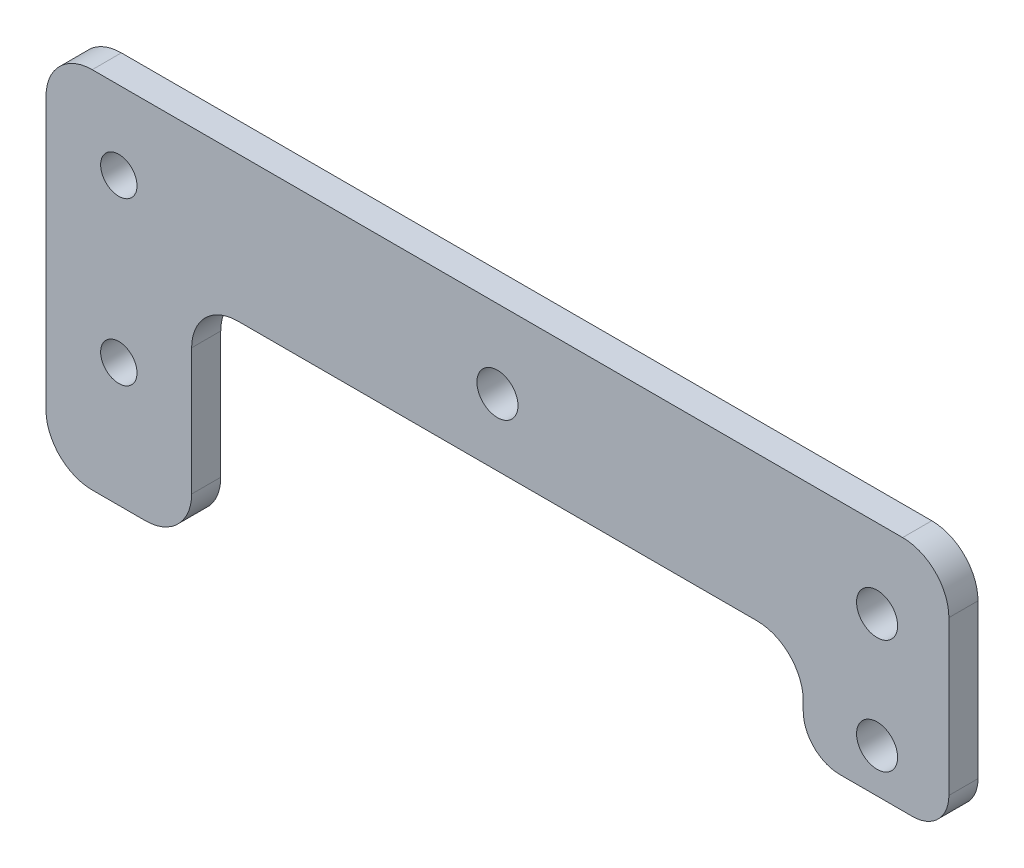
ISO-10303-21;
HEADER;
FILE_DESCRIPTION(('STEP AP214'),'2;1');
FILE_NAME('part.step','',(''),(''),'','','');
FILE_SCHEMA(('AUTOMOTIVE_DESIGN { 1 0 10303 214 1 1 1 1 }'));
ENDSEC;
DATA;
#1=APPLICATION_CONTEXT('core data for automotive mechanical design processes');
#2=APPLICATION_PROTOCOL_DEFINITION('international standard','automotive_design',2000,#1);
#3=PRODUCT_CONTEXT('',#1,'mechanical');
#4=PRODUCT('Part','Part','',(#3));
#5=PRODUCT_RELATED_PRODUCT_CATEGORY('part','',(#4));
#6=PRODUCT_DEFINITION_FORMATION('','',#4);
#7=PRODUCT_DEFINITION_CONTEXT('part definition',#1,'design');
#8=PRODUCT_DEFINITION('design','',#6,#7);
#9=PRODUCT_DEFINITION_SHAPE('','',#8);
#10=(LENGTH_UNIT() NAMED_UNIT(*) SI_UNIT(.MILLI.,.METRE.));
#11=(NAMED_UNIT(*) PLANE_ANGLE_UNIT() SI_UNIT($,.RADIAN.));
#12=(NAMED_UNIT(*) SI_UNIT($,.STERADIAN.) SOLID_ANGLE_UNIT());
#13=UNCERTAINTY_MEASURE_WITH_UNIT(LENGTH_MEASURE(1.E-05),#10,'distance_accuracy_value','');
#14=(GEOMETRIC_REPRESENTATION_CONTEXT(3) GLOBAL_UNCERTAINTY_ASSIGNED_CONTEXT((#13)) GLOBAL_UNIT_ASSIGNED_CONTEXT((#10,
#11,#12)) REPRESENTATION_CONTEXT('',''));
#15=CARTESIAN_POINT('',(0.,0.,0.));
#16=DIRECTION('',(0.,0.,1.));
#17=DIRECTION('',(1.,0.,0.));
#18=AXIS2_PLACEMENT_3D('',#15,#16,#17);
#19=CARTESIAN_POINT('',(0.,26.6043563241678,4.));
#20=DIRECTION('',(0.,1.,0.));
#21=DIRECTION('',(-1.,0.,0.));
#22=AXIS2_PLACEMENT_3D('',#19,#20,#21);
#23=PLANE('',#22);
#24=DIRECTION('',(1.,0.,0.));
#25=VECTOR('',#24,1.);
#26=CARTESIAN_POINT('',(0.,26.6043563241678,0.));
#27=LINE('',#26,#25);
#28=CARTESIAN_POINT('',(6.39337520482172,26.6043563241678,0.));
#29=VERTEX_POINT('',#28);
#30=CARTESIAN_POINT('',(117.693375204822,26.6043563241678,0.));
#31=VERTEX_POINT('',#30);
#32=EDGE_CURVE('E216',#29,#31,#27,.T.);
#33=ORIENTED_EDGE('',*,*,#32,.F.);
#34=DIRECTION('',(0.,0.,-1.));
#35=VECTOR('',#34,1.);
#36=CARTESIAN_POINT('',(6.39337520482172,26.6043563241678,4.));
#37=LINE('',#36,#35);
#38=CARTESIAN_POINT('',(6.39337520482172,26.6043563241678,4.));
#39=VERTEX_POINT('',#38);
#40=EDGE_CURVE('E11',#39,#29,#37,.T.);
#41=ORIENTED_EDGE('',*,*,#40,.F.);
#42=DIRECTION('',(1.,0.,0.));
#43=VECTOR('',#42,1.);
#44=CARTESIAN_POINT('',(0.,26.6043563241678,4.));
#45=LINE('',#44,#43);
#46=CARTESIAN_POINT('',(117.693375204822,26.6043563241678,4.));
#47=VERTEX_POINT('',#46);
#48=EDGE_CURVE('E351',#39,#47,#45,.T.);
#49=ORIENTED_EDGE('',*,*,#48,.T.);
#50=DIRECTION('',(0.,0.,-1.));
#51=VECTOR('',#50,1.);
#52=CARTESIAN_POINT('',(117.693375204822,26.6043563241678,4.));
#53=LINE('',#52,#51);
#54=EDGE_CURVE('E123',#47,#31,#53,.T.);
#55=ORIENTED_EDGE('',*,*,#54,.T.);
#56=EDGE_LOOP('',(#33,#41,#49,#55));
#57=FACE_BOUND('',#56,.T.);
#58=ADVANCED_FACE('F47',(#57),#23,.T.);
#59=CARTESIAN_POINT('',(6.39337520482172,20.2543563241678,4.));
#60=DIRECTION('',(0.,0.,-1.));
#61=DIRECTION('',(-1.,0.,0.));
#62=AXIS2_PLACEMENT_3D('',#59,#60,#61);
#63=CYLINDRICAL_SURFACE('',#62,6.35);
#64=CARTESIAN_POINT('',(6.39337520482172,20.2543563241678,0.));
#65=DIRECTION('',(0.,0.,1.));
#66=DIRECTION('',(1.,0.,0.));
#67=AXIS2_PLACEMENT_3D('',#64,#65,#66);
#68=CIRCLE('',#67,6.35);
#69=CARTESIAN_POINT('',(0.0433752048217246,20.2543563241678,0.));
#70=VERTEX_POINT('',#69);
#71=EDGE_CURVE('E220',#29,#70,#68,.T.);
#72=ORIENTED_EDGE('',*,*,#71,.T.);
#73=DIRECTION('',(0.,0.,-1.));
#74=VECTOR('',#73,1.);
#75=CARTESIAN_POINT('',(0.0433752048217246,20.2543563241678,4.));
#76=LINE('',#75,#74);
#77=CARTESIAN_POINT('',(0.0433752048217246,20.2543563241678,4.));
#78=VERTEX_POINT('',#77);
#79=EDGE_CURVE('E57',#78,#70,#76,.T.);
#80=ORIENTED_EDGE('',*,*,#79,.F.);
#81=CARTESIAN_POINT('',(6.39337520482172,20.2543563241678,4.));
#82=DIRECTION('',(0.,0.,1.));
#83=DIRECTION('',(1.,0.,0.));
#84=AXIS2_PLACEMENT_3D('',#81,#82,#83);
#85=CIRCLE('',#84,6.35);
#86=EDGE_CURVE('E344',#39,#78,#85,.T.);
#87=ORIENTED_EDGE('',*,*,#86,.F.);
#88=ORIENTED_EDGE('',*,*,#40,.T.);
#89=EDGE_LOOP('',(#72,#80,#87,#88));
#90=FACE_BOUND('',#89,.T.);
#91=ADVANCED_FACE('F331',(#90),#63,.T.);
#92=CARTESIAN_POINT('',(0.0433752048217246,0.,4.));
#93=DIRECTION('',(-1.,0.,0.));
#94=DIRECTION('',(0.,-1.,0.));
#95=AXIS2_PLACEMENT_3D('',#92,#93,#94);
#96=PLANE('',#95);
#97=DIRECTION('',(0.,1.,0.));
#98=VECTOR('',#97,1.);
#99=CARTESIAN_POINT('',(0.0433752048217246,0.,0.));
#100=LINE('',#99,#98);
#101=CARTESIAN_POINT('',(0.0433752048217247,-17.0456436758322,0.));
#102=VERTEX_POINT('',#101);
#103=EDGE_CURVE('E224',#102,#70,#100,.T.);
#104=ORIENTED_EDGE('',*,*,#103,.F.);
#105=DIRECTION('',(0.,0.,-1.));
#106=VECTOR('',#105,1.);
#107=CARTESIAN_POINT('',(0.0433752048217247,-17.0456436758322,4.));
#108=LINE('',#107,#106);
#109=CARTESIAN_POINT('',(0.0433752048217247,-17.0456436758322,4.));
#110=VERTEX_POINT('',#109);
#111=EDGE_CURVE('E319',#110,#102,#108,.T.);
#112=ORIENTED_EDGE('',*,*,#111,.F.);
#113=DIRECTION('',(0.,1.,0.));
#114=VECTOR('',#113,1.);
#115=CARTESIAN_POINT('',(0.0433752048217246,0.,4.));
#116=LINE('',#115,#114);
#117=EDGE_CURVE('E328',#110,#78,#116,.T.);
#118=ORIENTED_EDGE('',*,*,#117,.T.);
#119=ORIENTED_EDGE('',*,*,#79,.T.);
#120=EDGE_LOOP('',(#104,#112,#118,#119));
#121=FACE_BOUND('',#120,.T.);
#122=ADVANCED_FACE('F326',(#121),#96,.T.);
#123=CARTESIAN_POINT('',(6.39337520482172,-17.0456436758322,4.));
#124=DIRECTION('',(0.,0.,-1.));
#125=DIRECTION('',(-1.,0.,0.));
#126=AXIS2_PLACEMENT_3D('',#123,#124,#125);
#127=CYLINDRICAL_SURFACE('',#126,6.35);
#128=CARTESIAN_POINT('',(6.39337520482172,-17.0456436758322,0.));
#129=DIRECTION('',(0.,0.,1.));
#130=DIRECTION('',(1.,0.,0.));
#131=AXIS2_PLACEMENT_3D('',#128,#129,#130);
#132=CIRCLE('',#131,6.35);
#133=CARTESIAN_POINT('',(6.39337520482172,-23.3956436758322,0.));
#134=VERTEX_POINT('',#133);
#135=EDGE_CURVE('E228',#134,#102,#132,.F.);
#136=ORIENTED_EDGE('',*,*,#135,.F.);
#137=DIRECTION('',(0.,0.,-1.));
#138=VECTOR('',#137,1.);
#139=CARTESIAN_POINT('',(6.39337520482172,-23.3956436758322,4.));
#140=LINE('',#139,#138);
#141=CARTESIAN_POINT('',(6.39337520482172,-23.3956436758322,4.));
#142=VERTEX_POINT('',#141);
#143=EDGE_CURVE('E316',#142,#134,#140,.T.);
#144=ORIENTED_EDGE('',*,*,#143,.F.);
#145=CARTESIAN_POINT('',(6.39337520482172,-17.0456436758322,4.));
#146=DIRECTION('',(0.,0.,1.));
#147=DIRECTION('',(1.,0.,0.));
#148=AXIS2_PLACEMENT_3D('',#145,#146,#147);
#149=CIRCLE('',#148,6.35);
#150=EDGE_CURVE('E342',#142,#110,#149,.F.);
#151=ORIENTED_EDGE('',*,*,#150,.T.);
#152=ORIENTED_EDGE('',*,*,#111,.T.);
#153=EDGE_LOOP('',(#136,#144,#151,#152));
#154=FACE_BOUND('',#153,.T.);
#155=ADVANCED_FACE('F338',(#154),#127,.T.);
#156=CARTESIAN_POINT('',(0.,-23.3956436758322,4.));
#157=DIRECTION('',(0.,1.,0.));
#158=DIRECTION('',(0.,0.,1.));
#159=AXIS2_PLACEMENT_3D('',#156,#157,#158);
#160=PLANE('',#159);
#161=DIRECTION('',(1.,0.,0.));
#162=VECTOR('',#161,1.);
#163=CARTESIAN_POINT('',(0.,-23.3956436758322,0.));
#164=LINE('',#163,#162);
#165=CARTESIAN_POINT('',(13.6933752048217,-23.3956436758322,0.));
#166=VERTEX_POINT('',#165);
#167=EDGE_CURVE('E232',#134,#166,#164,.T.);
#168=ORIENTED_EDGE('',*,*,#167,.T.);
#169=DIRECTION('',(0.,0.,-1.));
#170=VECTOR('',#169,1.);
#171=CARTESIAN_POINT('',(13.6933752048217,-23.3956436758322,4.));
#172=LINE('',#171,#170);
#173=CARTESIAN_POINT('',(13.6933752048217,-23.3956436758322,4.));
#174=VERTEX_POINT('',#173);
#175=EDGE_CURVE('E312',#174,#166,#172,.T.);
#176=ORIENTED_EDGE('',*,*,#175,.F.);
#177=DIRECTION('',(1.,0.,0.));
#178=VECTOR('',#177,1.);
#179=CARTESIAN_POINT('',(0.,-23.3956436758322,4.));
#180=LINE('',#179,#178);
#181=EDGE_CURVE('E349',#142,#174,#180,.T.);
#182=ORIENTED_EDGE('',*,*,#181,.F.);
#183=ORIENTED_EDGE('',*,*,#143,.T.);
#184=EDGE_LOOP('',(#168,#176,#182,#183));
#185=FACE_BOUND('',#184,.T.);
#186=ADVANCED_FACE('F487',(#185),#160,.F.);
#187=CARTESIAN_POINT('',(13.6933752048217,-17.0456436758322,4.));
#188=DIRECTION('',(0.,0.,-1.));
#189=DIRECTION('',(-1.,0.,0.));
#190=AXIS2_PLACEMENT_3D('',#187,#188,#189);
#191=CYLINDRICAL_SURFACE('',#190,6.35);
#192=CARTESIAN_POINT('',(13.6933752048217,-17.0456436758322,0.));
#193=DIRECTION('',(0.,0.,1.));
#194=DIRECTION('',(1.,0.,0.));
#195=AXIS2_PLACEMENT_3D('',#192,#193,#194);
#196=CIRCLE('',#195,6.35);
#197=CARTESIAN_POINT('',(20.0433752048217,-17.0456436758322,0.));
#198=VERTEX_POINT('',#197);
#199=EDGE_CURVE('E236',#166,#198,#196,.T.);
#200=ORIENTED_EDGE('',*,*,#199,.T.);
#201=DIRECTION('',(0.,0.,-1.));
#202=VECTOR('',#201,1.);
#203=CARTESIAN_POINT('',(20.0433752048217,-17.0456436758322,4.));
#204=LINE('',#203,#202);
#205=CARTESIAN_POINT('',(20.0433752048217,-17.0456436758322,4.));
#206=VERTEX_POINT('',#205);
#207=EDGE_CURVE('E309',#206,#198,#204,.T.);
#208=ORIENTED_EDGE('',*,*,#207,.F.);
#209=CARTESIAN_POINT('',(13.6933752048217,-17.0456436758322,4.));
#210=DIRECTION('',(0.,0.,1.));
#211=DIRECTION('',(1.,0.,0.));
#212=AXIS2_PLACEMENT_3D('',#209,#210,#211);
#213=CIRCLE('',#212,6.35);
#214=EDGE_CURVE('E357',#174,#206,#213,.T.);
#215=ORIENTED_EDGE('',*,*,#214,.F.);
#216=ORIENTED_EDGE('',*,*,#175,.T.);
#217=EDGE_LOOP('',(#200,#208,#215,#216));
#218=FACE_BOUND('',#217,.T.);
#219=ADVANCED_FACE('F483',(#218),#191,.T.);
#220=CARTESIAN_POINT('',(20.0433752048217,0.,4.));
#221=DIRECTION('',(1.,0.,0.));
#222=DIRECTION('',(0.,1.,0.));
#223=AXIS2_PLACEMENT_3D('',#220,#221,#222);
#224=PLANE('',#223);
#225=DIRECTION('',(0.,-1.,0.));
#226=VECTOR('',#225,1.);
#227=CARTESIAN_POINT('',(20.0433752048217,0.,0.));
#228=LINE('',#227,#226);
#229=CARTESIAN_POINT('',(20.0433752048217,0.349416953919621,0.));
#230=VERTEX_POINT('',#229);
#231=EDGE_CURVE('E240',#230,#198,#228,.T.);
#232=ORIENTED_EDGE('',*,*,#231,.F.);
#233=DIRECTION('',(0.,0.,-1.));
#234=VECTOR('',#233,1.);
#235=CARTESIAN_POINT('',(20.0433752048217,0.349416953919621,4.));
#236=LINE('',#235,#234);
#237=CARTESIAN_POINT('',(20.0433752048217,0.349416953919621,4.));
#238=VERTEX_POINT('',#237);
#239=EDGE_CURVE('E306',#238,#230,#236,.T.);
#240=ORIENTED_EDGE('',*,*,#239,.F.);
#241=DIRECTION('',(0.,-1.,0.));
#242=VECTOR('',#241,1.);
#243=CARTESIAN_POINT('',(20.0433752048217,0.,4.));
#244=LINE('',#243,#242);
#245=EDGE_CURVE('E360',#238,#206,#244,.T.);
#246=ORIENTED_EDGE('',*,*,#245,.T.);
#247=ORIENTED_EDGE('',*,*,#207,.T.);
#248=EDGE_LOOP('',(#232,#240,#246,#247));
#249=FACE_BOUND('',#248,.T.);
#250=ADVANCED_FACE('F479',(#249),#224,.T.);
#251=CARTESIAN_POINT('',(26.3933752048217,0.349416953919621,4.));
#252=DIRECTION('',(0.,0.,-1.));
#253=DIRECTION('',(-1.,0.,0.));
#254=AXIS2_PLACEMENT_3D('',#251,#252,#253);
#255=CYLINDRICAL_SURFACE('',#254,6.35);
#256=CARTESIAN_POINT('',(26.3933752048217,0.349416953919621,0.));
#257=DIRECTION('',(0.,0.,1.));
#258=DIRECTION('',(1.,0.,0.));
#259=AXIS2_PLACEMENT_3D('',#256,#257,#258);
#260=CIRCLE('',#259,6.35);
#261=CARTESIAN_POINT('',(26.3933752048217,6.69941695391962,0.));
#262=VERTEX_POINT('',#261);
#263=EDGE_CURVE('E244',#262,#230,#260,.T.);
#264=ORIENTED_EDGE('',*,*,#263,.F.);
#265=DIRECTION('',(0.,0.,-1.));
#266=VECTOR('',#265,1.);
#267=CARTESIAN_POINT('',(26.3933752048217,6.69941695391962,4.));
#268=LINE('',#267,#266);
#269=CARTESIAN_POINT('',(26.3933752048217,6.69941695391962,4.));
#270=VERTEX_POINT('',#269);
#271=EDGE_CURVE('E303',#270,#262,#268,.T.);
#272=ORIENTED_EDGE('',*,*,#271,.F.);
#273=CARTESIAN_POINT('',(26.3933752048217,0.349416953919621,4.));
#274=DIRECTION('',(0.,0.,1.));
#275=DIRECTION('',(1.,0.,0.));
#276=AXIS2_PLACEMENT_3D('',#273,#274,#275);
#277=CIRCLE('',#276,6.35);
#278=EDGE_CURVE('E364',#270,#238,#277,.T.);
#279=ORIENTED_EDGE('',*,*,#278,.T.);
#280=ORIENTED_EDGE('',*,*,#239,.T.);
#281=EDGE_LOOP('',(#264,#272,#279,#280));
#282=FACE_BOUND('',#281,.T.);
#283=ADVANCED_FACE('F475',(#282),#255,.F.);
#284=CARTESIAN_POINT('',(0.,6.69941695391962,4.));
#285=DIRECTION('',(0.,1.,0.));
#286=DIRECTION('',(0.,0.,1.));
#287=AXIS2_PLACEMENT_3D('',#284,#285,#286);
#288=PLANE('',#287);
#289=DIRECTION('',(1.,0.,0.));
#290=VECTOR('',#289,1.);
#291=CARTESIAN_POINT('',(0.,6.69941695391962,0.));
#292=LINE('',#291,#290);
#293=CARTESIAN_POINT('',(97.6933752048217,6.69941695391962,0.));
#294=VERTEX_POINT('',#293);
#295=EDGE_CURVE('E248',#262,#294,#292,.T.);
#296=ORIENTED_EDGE('',*,*,#295,.T.);
#297=DIRECTION('',(0.,0.,-1.));
#298=VECTOR('',#297,1.);
#299=CARTESIAN_POINT('',(97.6933752048217,6.69941695391962,4.));
#300=LINE('',#299,#298);
#301=CARTESIAN_POINT('',(97.6933752048217,6.69941695391962,4.));
#302=VERTEX_POINT('',#301);
#303=EDGE_CURVE('E300',#302,#294,#300,.T.);
#304=ORIENTED_EDGE('',*,*,#303,.F.);
#305=DIRECTION('',(1.,0.,0.));
#306=VECTOR('',#305,1.);
#307=CARTESIAN_POINT('',(0.,6.69941695391962,4.));
#308=LINE('',#307,#306);
#309=EDGE_CURVE('E368',#270,#302,#308,.T.);
#310=ORIENTED_EDGE('',*,*,#309,.F.);
#311=ORIENTED_EDGE('',*,*,#271,.T.);
#312=EDGE_LOOP('',(#296,#304,#310,#311));
#313=FACE_BOUND('',#312,.T.);
#314=ADVANCED_FACE('F471',(#313),#288,.F.);
#315=CARTESIAN_POINT('',(97.6933752048217,0.349416953919621,4.));
#316=DIRECTION('',(0.,0.,-1.));
#317=DIRECTION('',(-1.,0.,0.));
#318=AXIS2_PLACEMENT_3D('',#315,#316,#317);
#319=CYLINDRICAL_SURFACE('',#318,6.35);
#320=CARTESIAN_POINT('',(97.6933752048217,0.349416953919621,0.));
#321=DIRECTION('',(0.,0.,1.));
#322=DIRECTION('',(1.,0.,0.));
#323=AXIS2_PLACEMENT_3D('',#320,#321,#322);
#324=CIRCLE('',#323,6.35);
#325=CARTESIAN_POINT('',(104.043375204822,0.349416953919631,0.));
#326=VERTEX_POINT('',#325);
#327=EDGE_CURVE('E252',#326,#294,#324,.T.);
#328=ORIENTED_EDGE('',*,*,#327,.F.);
#329=DIRECTION('',(0.,0.,-1.));
#330=VECTOR('',#329,1.);
#331=CARTESIAN_POINT('',(104.043375204822,0.349416953919631,4.));
#332=LINE('',#331,#330);
#333=CARTESIAN_POINT('',(104.043375204822,0.349416953919631,4.));
#334=VERTEX_POINT('',#333);
#335=EDGE_CURVE('E297',#334,#326,#332,.T.);
#336=ORIENTED_EDGE('',*,*,#335,.F.);
#337=CARTESIAN_POINT('',(97.6933752048217,0.349416953919621,4.));
#338=DIRECTION('',(0.,0.,1.));
#339=DIRECTION('',(1.,0.,0.));
#340=AXIS2_PLACEMENT_3D('',#337,#338,#339);
#341=CIRCLE('',#340,6.35);
#342=EDGE_CURVE('E371',#334,#302,#341,.T.);
#343=ORIENTED_EDGE('',*,*,#342,.T.);
#344=ORIENTED_EDGE('',*,*,#303,.T.);
#345=EDGE_LOOP('',(#328,#336,#343,#344));
#346=FACE_BOUND('',#345,.T.);
#347=ADVANCED_FACE('F467',(#346),#319,.F.);
#348=CARTESIAN_POINT('',(104.043375204822,0.,4.));
#349=DIRECTION('',(-1.,0.,0.));
#350=DIRECTION('',(0.,0.,1.));
#351=AXIS2_PLACEMENT_3D('',#348,#349,#350);
#352=PLANE('',#351);
#353=DIRECTION('',(0.,1.,0.));
#354=VECTOR('',#353,1.);
#355=CARTESIAN_POINT('',(104.043375204822,0.,0.));
#356=LINE('',#355,#354);
#357=CARTESIAN_POINT('',(104.043375204822,-0.895643675832241,0.));
#358=VERTEX_POINT('',#357);
#359=EDGE_CURVE('E256',#358,#326,#356,.T.);
#360=ORIENTED_EDGE('',*,*,#359,.F.);
#361=DIRECTION('',(0.,0.,-1.));
#362=VECTOR('',#361,1.);
#363=CARTESIAN_POINT('',(104.043375204822,-0.895643675832241,4.));
#364=LINE('',#363,#362);
#365=CARTESIAN_POINT('',(104.043375204822,-0.895643675832241,4.));
#366=VERTEX_POINT('',#365);
#367=EDGE_CURVE('E294',#366,#358,#364,.T.);
#368=ORIENTED_EDGE('',*,*,#367,.F.);
#369=DIRECTION('',(0.,1.,0.));
#370=VECTOR('',#369,1.);
#371=CARTESIAN_POINT('',(104.043375204822,0.,4.));
#372=LINE('',#371,#370);
#373=EDGE_CURVE('E375',#366,#334,#372,.T.);
#374=ORIENTED_EDGE('',*,*,#373,.T.);
#375=ORIENTED_EDGE('',*,*,#335,.T.);
#376=EDGE_LOOP('',(#360,#368,#374,#375));
#377=FACE_BOUND('',#376,.T.);
#378=ADVANCED_FACE('F463',(#377),#352,.T.);
#379=CARTESIAN_POINT('',(109.043375204822,-0.895643675832241,4.));
#380=DIRECTION('',(0.,0.,-1.));
#381=DIRECTION('',(-1.,0.,0.));
#382=AXIS2_PLACEMENT_3D('',#379,#380,#381);
#383=CYLINDRICAL_SURFACE('',#382,5.);
#384=CARTESIAN_POINT('',(109.043375204822,-0.895643675832241,0.));
#385=DIRECTION('',(0.,0.,1.));
#386=DIRECTION('',(1.,0.,0.));
#387=AXIS2_PLACEMENT_3D('',#384,#385,#386);
#388=CIRCLE('',#387,5.);
#389=CARTESIAN_POINT('',(109.043375204822,-5.89564367583224,0.));
#390=VERTEX_POINT('',#389);
#391=EDGE_CURVE('E260',#390,#358,#388,.F.);
#392=ORIENTED_EDGE('',*,*,#391,.F.);
#393=DIRECTION('',(0.,0.,-1.));
#394=VECTOR('',#393,1.);
#395=CARTESIAN_POINT('',(109.043375204822,-5.89564367583224,4.));
#396=LINE('',#395,#394);
#397=CARTESIAN_POINT('',(109.043375204822,-5.89564367583224,4.));
#398=VERTEX_POINT('',#397);
#399=EDGE_CURVE('E291',#398,#390,#396,.T.);
#400=ORIENTED_EDGE('',*,*,#399,.F.);
#401=CARTESIAN_POINT('',(109.043375204822,-0.895643675832241,4.));
#402=DIRECTION('',(0.,0.,1.));
#403=DIRECTION('',(1.,0.,0.));
#404=AXIS2_PLACEMENT_3D('',#401,#402,#403);
#405=CIRCLE('',#404,5.);
#406=EDGE_CURVE('E379',#398,#366,#405,.F.);
#407=ORIENTED_EDGE('',*,*,#406,.T.);
#408=ORIENTED_EDGE('',*,*,#367,.T.);
#409=EDGE_LOOP('',(#392,#400,#407,#408));
#410=FACE_BOUND('',#409,.T.);
#411=ADVANCED_FACE('F460',(#410),#383,.T.);
#412=CARTESIAN_POINT('',(0.,-5.89564367583225,4.));
#413=DIRECTION('',(0.,-1.,0.));
#414=DIRECTION('',(1.,0.,0.));
#415=AXIS2_PLACEMENT_3D('',#412,#413,#414);
#416=PLANE('',#415);
#417=DIRECTION('',(-1.,0.,0.));
#418=VECTOR('',#417,1.);
#419=CARTESIAN_POINT('',(0.,-5.89564367583225,0.));
#420=LINE('',#419,#418);
#421=CARTESIAN_POINT('',(119.043375204822,-5.89564367583224,0.));
#422=VERTEX_POINT('',#421);
#423=EDGE_CURVE('E264',#422,#390,#420,.T.);
#424=ORIENTED_EDGE('',*,*,#423,.F.);
#425=DIRECTION('',(0.,0.,-1.));
#426=VECTOR('',#425,1.);
#427=CARTESIAN_POINT('',(119.043375204822,-5.89564367583224,4.));
#428=LINE('',#427,#426);
#429=CARTESIAN_POINT('',(119.043375204822,-5.89564367583224,4.));
#430=VERTEX_POINT('',#429);
#431=EDGE_CURVE('E187',#430,#422,#428,.T.);
#432=ORIENTED_EDGE('',*,*,#431,.F.);
#433=DIRECTION('',(-1.,0.,0.));
#434=VECTOR('',#433,1.);
#435=CARTESIAN_POINT('',(0.,-5.89564367583225,4.));
#436=LINE('',#435,#434);
#437=EDGE_CURVE('E174',#430,#398,#436,.T.);
#438=ORIENTED_EDGE('',*,*,#437,.T.);
#439=ORIENTED_EDGE('',*,*,#399,.T.);
#440=EDGE_LOOP('',(#424,#432,#438,#439));
#441=FACE_BOUND('',#440,.T.);
#442=ADVANCED_FACE('F385',(#441),#416,.T.);
#443=CARTESIAN_POINT('',(119.043375204822,-0.89564367583224,4.));
#444=DIRECTION('',(0.,0.,-1.));
#445=DIRECTION('',(-1.,0.,0.));
#446=AXIS2_PLACEMENT_3D('',#443,#444,#445);
#447=CYLINDRICAL_SURFACE('',#446,5.);
#448=CARTESIAN_POINT('',(119.043375204822,-0.89564367583224,0.));
#449=DIRECTION('',(0.,0.,1.));
#450=DIRECTION('',(1.,0.,0.));
#451=AXIS2_PLACEMENT_3D('',#448,#449,#450);
#452=CIRCLE('',#451,5.);
#453=CARTESIAN_POINT('',(124.043375204822,-0.895643675832239,0.));
#454=VERTEX_POINT('',#453);
#455=EDGE_CURVE('E182',#422,#454,#452,.T.);
#456=ORIENTED_EDGE('',*,*,#455,.T.);
#457=DIRECTION('',(0.,0.,-1.));
#458=VECTOR('',#457,1.);
#459=CARTESIAN_POINT('',(124.043375204822,-0.895643675832239,4.));
#460=LINE('',#459,#458);
#461=CARTESIAN_POINT('',(124.043375204822,-0.895643675832239,4.));
#462=VERTEX_POINT('',#461);
#463=EDGE_CURVE('E179',#462,#454,#460,.T.);
#464=ORIENTED_EDGE('',*,*,#463,.F.);
#465=CARTESIAN_POINT('',(119.043375204822,-0.89564367583224,4.));
#466=DIRECTION('',(0.,0.,1.));
#467=DIRECTION('',(1.,0.,0.));
#468=AXIS2_PLACEMENT_3D('',#465,#466,#467);
#469=CIRCLE('',#468,5.);
#470=EDGE_CURVE('E166',#430,#462,#469,.T.);
#471=ORIENTED_EDGE('',*,*,#470,.F.);
#472=ORIENTED_EDGE('',*,*,#431,.T.);
#473=EDGE_LOOP('',(#456,#464,#471,#472));
#474=FACE_BOUND('',#473,.T.);
#475=ADVANCED_FACE('F180',(#474),#447,.T.);
#476=CARTESIAN_POINT('',(124.043375204822,0.,4.));
#477=DIRECTION('',(1.,0.,0.));
#478=DIRECTION('',(0.,0.,-1.));
#479=AXIS2_PLACEMENT_3D('',#476,#477,#478);
#480=PLANE('',#479);
#481=DIRECTION('',(0.,-1.,0.));
#482=VECTOR('',#481,1.);
#483=CARTESIAN_POINT('',(124.043375204822,0.,0.));
#484=LINE('',#483,#482);
#485=CARTESIAN_POINT('',(124.043375204822,20.2543563241678,0.));
#486=VERTEX_POINT('',#485);
#487=EDGE_CURVE('E270',#486,#454,#484,.T.);
#488=ORIENTED_EDGE('',*,*,#487,.F.);
#489=DIRECTION('',(0.,0.,-1.));
#490=VECTOR('',#489,1.);
#491=CARTESIAN_POINT('',(124.043375204822,20.2543563241678,4.));
#492=LINE('',#491,#490);
#493=CARTESIAN_POINT('',(124.043375204822,20.2543563241678,4.));
#494=VERTEX_POINT('',#493);
#495=EDGE_CURVE('E116',#494,#486,#492,.T.);
#496=ORIENTED_EDGE('',*,*,#495,.F.);
#497=DIRECTION('',(0.,-1.,0.));
#498=VECTOR('',#497,1.);
#499=CARTESIAN_POINT('',(124.043375204822,0.,4.));
#500=LINE('',#499,#498);
#501=EDGE_CURVE('E171',#494,#462,#500,.T.);
#502=ORIENTED_EDGE('',*,*,#501,.T.);
#503=ORIENTED_EDGE('',*,*,#463,.T.);
#504=EDGE_LOOP('',(#488,#496,#502,#503));
#505=FACE_BOUND('',#504,.T.);
#506=ADVANCED_FACE('F189',(#505),#480,.T.);
#507=CARTESIAN_POINT('',(10.0433752048217,-6.39564367583229,4.));
#508=DIRECTION('',(0.,0.,-1.));
#509=DIRECTION('',(-1.,0.,0.));
#510=AXIS2_PLACEMENT_3D('',#507,#508,#509);
#511=CYLINDRICAL_SURFACE('',#510,2.5);
#512=CARTESIAN_POINT('',(10.0433752048217,-6.39564367583229,4.));
#513=DIRECTION('',(0.,0.,1.));
#514=DIRECTION('',(1.,0.,0.));
#515=AXIS2_PLACEMENT_3D('',#512,#513,#514);
#516=CIRCLE('',#515,2.5);
#517=CARTESIAN_POINT('',(12.5433752048217,-6.39564367583229,4.));
#518=VERTEX_POINT('',#517);
#519=EDGE_CURVE('E193',#518,#518,#516,.T.);
#520=ORIENTED_EDGE('',*,*,#519,.T.);
#521=EDGE_LOOP('',(#520));
#522=FACE_BOUND('',#521,.T.);
#523=CARTESIAN_POINT('',(10.0433752048217,-6.39564367583229,0.));
#524=DIRECTION('',(0.,0.,1.));
#525=DIRECTION('',(1.,0.,0.));
#526=AXIS2_PLACEMENT_3D('',#523,#524,#525);
#527=CIRCLE('',#526,2.5);
#528=CARTESIAN_POINT('',(12.5433752048217,-6.39564367583229,0.));
#529=VERTEX_POINT('',#528);
#530=EDGE_CURVE('E276',#529,#529,#527,.T.);
#531=ORIENTED_EDGE('',*,*,#530,.F.);
#532=EDGE_LOOP('',(#531));
#533=FACE_BOUND('',#532,.T.);
#534=ADVANCED_FACE('F448',(#522,#533),#511,.F.);
#535=CARTESIAN_POINT('',(117.693375204822,20.2543563241678,4.));
#536=DIRECTION('',(0.,0.,-1.));
#537=DIRECTION('',(-1.,0.,0.));
#538=AXIS2_PLACEMENT_3D('',#535,#536,#537);
#539=CYLINDRICAL_SURFACE('',#538,6.35);
#540=CARTESIAN_POINT('',(117.693375204822,20.2543563241678,0.));
#541=DIRECTION('',(0.,0.,1.));
#542=DIRECTION('',(1.,0.,0.));
#543=AXIS2_PLACEMENT_3D('',#540,#541,#542);
#544=CIRCLE('',#543,6.35);
#545=EDGE_CURVE('E273',#486,#31,#544,.T.);
#546=ORIENTED_EDGE('',*,*,#545,.T.);
#547=ORIENTED_EDGE('',*,*,#54,.F.);
#548=CARTESIAN_POINT('',(117.693375204822,20.2543563241678,4.));
#549=DIRECTION('',(0.,0.,1.));
#550=DIRECTION('',(1.,0.,0.));
#551=AXIS2_PLACEMENT_3D('',#548,#549,#550);
#552=CIRCLE('',#551,6.35);
#553=EDGE_CURVE('E65',#494,#47,#552,.T.);
#554=ORIENTED_EDGE('',*,*,#553,.F.);
#555=ORIENTED_EDGE('',*,*,#495,.T.);
#556=EDGE_LOOP('',(#546,#547,#554,#555));
#557=FACE_BOUND('',#556,.T.);
#558=ADVANCED_FACE('F387',(#557),#539,.T.);
#559=CARTESIAN_POINT('',(114.183375204822,0.104356324167762,4.));
#560=DIRECTION('',(0.,0.,-1.));
#561=DIRECTION('',(-1.,0.,0.));
#562=AXIS2_PLACEMENT_3D('',#559,#560,#561);
#563=CYLINDRICAL_SURFACE('',#562,2.8213685039973);
#564=CARTESIAN_POINT('',(114.183375204822,0.104356324167762,4.));
#565=DIRECTION('',(0.,0.,1.));
#566=DIRECTION('',(1.,0.,0.));
#567=AXIS2_PLACEMENT_3D('',#564,#565,#566);
#568=CIRCLE('',#567,2.8213685039973);
#569=CARTESIAN_POINT('',(117.004743708819,0.104356324167762,4.));
#570=VERTEX_POINT('',#569);
#571=EDGE_CURVE('E389',#570,#570,#568,.T.);
#572=ORIENTED_EDGE('',*,*,#571,.T.);
#573=EDGE_LOOP('',(#572));
#574=FACE_BOUND('',#573,.T.);
#575=CARTESIAN_POINT('',(114.183375204822,0.104356324167762,0.));
#576=DIRECTION('',(0.,0.,1.));
#577=DIRECTION('',(1.,0.,0.));
#578=AXIS2_PLACEMENT_3D('',#575,#576,#577);
#579=CIRCLE('',#578,2.8213685039973);
#580=CARTESIAN_POINT('',(117.004743708819,0.104356324167762,0.));
#581=VERTEX_POINT('',#580);
#582=EDGE_CURVE('E212',#581,#581,#579,.T.);
#583=ORIENTED_EDGE('',*,*,#582,.F.);
#584=EDGE_LOOP('',(#583));
#585=FACE_BOUND('',#584,.T.);
#586=ADVANCED_FACE('F412',(#574,#585),#563,.F.);
#587=CARTESIAN_POINT('',(114.183375204822,15.771437703016,4.));
#588=DIRECTION('',(0.,0.,-1.));
#589=DIRECTION('',(-1.,0.,0.));
#590=AXIS2_PLACEMENT_3D('',#587,#588,#589);
#591=CYLINDRICAL_SURFACE('',#590,2.82136850399728);
#592=CARTESIAN_POINT('',(114.183375204822,15.771437703016,4.));
#593=DIRECTION('',(0.,0.,1.));
#594=DIRECTION('',(1.,0.,0.));
#595=AXIS2_PLACEMENT_3D('',#592,#593,#594);
#596=CIRCLE('',#595,2.82136850399728);
#597=CARTESIAN_POINT('',(117.004743708819,15.771437703016,4.));
#598=VERTEX_POINT('',#597);
#599=EDGE_CURVE('E392',#598,#598,#596,.T.);
#600=ORIENTED_EDGE('',*,*,#599,.T.);
#601=EDGE_LOOP('',(#600));
#602=FACE_BOUND('',#601,.T.);
#603=CARTESIAN_POINT('',(114.183375204822,15.771437703016,0.));
#604=DIRECTION('',(0.,0.,1.));
#605=DIRECTION('',(1.,0.,0.));
#606=AXIS2_PLACEMENT_3D('',#603,#604,#605);
#607=CIRCLE('',#606,2.82136850399728);
#608=CARTESIAN_POINT('',(117.004743708819,15.771437703016,0.));
#609=VERTEX_POINT('',#608);
#610=EDGE_CURVE('E208',#609,#609,#607,.T.);
#611=ORIENTED_EDGE('',*,*,#610,.F.);
#612=EDGE_LOOP('',(#611));
#613=FACE_BOUND('',#612,.T.);
#614=ADVANCED_FACE('F415',(#602,#613),#591,.F.);
#615=CARTESIAN_POINT('',(62.0433752048217,15.8664983327679,4.));
#616=DIRECTION('',(0.,0.,-1.));
#617=DIRECTION('',(-1.,0.,0.));
#618=AXIS2_PLACEMENT_3D('',#615,#616,#617);
#619=CYLINDRICAL_SURFACE('',#618,2.8213685039973);
#620=CARTESIAN_POINT('',(62.0433752048217,15.8664983327679,4.));
#621=DIRECTION('',(0.,0.,1.));
#622=DIRECTION('',(1.,0.,0.));
#623=AXIS2_PLACEMENT_3D('',#620,#621,#622);
#624=CIRCLE('',#623,2.8213685039973);
#625=CARTESIAN_POINT('',(64.864743708819,15.8664983327679,4.));
#626=VERTEX_POINT('',#625);
#627=EDGE_CURVE('E284',#626,#626,#624,.T.);
#628=ORIENTED_EDGE('',*,*,#627,.T.);
#629=EDGE_LOOP('',(#628));
#630=FACE_BOUND('',#629,.T.);
#631=CARTESIAN_POINT('',(62.0433752048217,15.8664983327679,0.));
#632=DIRECTION('',(0.,0.,1.));
#633=DIRECTION('',(1.,0.,0.));
#634=AXIS2_PLACEMENT_3D('',#631,#632,#633);
#635=CIRCLE('',#634,2.8213685039973);
#636=CARTESIAN_POINT('',(64.864743708819,15.8664983327679,0.));
#637=VERTEX_POINT('',#636);
#638=EDGE_CURVE('E204',#637,#637,#635,.T.);
#639=ORIENTED_EDGE('',*,*,#638,.F.);
#640=EDGE_LOOP('',(#639));
#641=FACE_BOUND('',#640,.T.);
#642=ADVANCED_FACE('F49',(#630,#641),#619,.F.);
#643=CARTESIAN_POINT('',(10.0433752048217,15.8664983327679,4.));
#644=DIRECTION('',(0.,0.,-1.));
#645=DIRECTION('',(-1.,0.,0.));
#646=AXIS2_PLACEMENT_3D('',#643,#644,#645);
#647=CYLINDRICAL_SURFACE('',#646,2.5);
#648=CARTESIAN_POINT('',(10.0433752048217,15.8664983327679,4.));
#649=DIRECTION('',(0.,0.,1.));
#650=DIRECTION('',(1.,0.,0.));
#651=AXIS2_PLACEMENT_3D('',#648,#649,#650);
#652=CIRCLE('',#651,2.5);
#653=CARTESIAN_POINT('',(12.5433752048217,15.8664983327679,4.));
#654=VERTEX_POINT('',#653);
#655=EDGE_CURVE('E200',#654,#654,#652,.T.);
#656=ORIENTED_EDGE('',*,*,#655,.T.);
#657=EDGE_LOOP('',(#656));
#658=FACE_BOUND('',#657,.T.);
#659=CARTESIAN_POINT('',(10.0433752048217,15.8664983327679,0.));
#660=DIRECTION('',(0.,0.,1.));
#661=DIRECTION('',(1.,0.,0.));
#662=AXIS2_PLACEMENT_3D('',#659,#660,#661);
#663=CIRCLE('',#662,2.5);
#664=CARTESIAN_POINT('',(12.5433752048217,15.8664983327679,0.));
#665=VERTEX_POINT('',#664);
#666=EDGE_CURVE('E280',#665,#665,#663,.T.);
#667=ORIENTED_EDGE('',*,*,#666,.F.);
#668=EDGE_LOOP('',(#667));
#669=FACE_BOUND('',#668,.T.);
#670=ADVANCED_FACE('F406',(#658,#669),#647,.F.);
#671=CARTESIAN_POINT('',(0.,0.,4.));
#672=DIRECTION('',(0.,0.,1.));
#673=DIRECTION('',(1.,0.,0.));
#674=AXIS2_PLACEMENT_3D('',#671,#672,#673);
#675=PLANE('',#674);
#676=ORIENTED_EDGE('',*,*,#627,.F.);
#677=EDGE_LOOP('',(#676));
#678=FACE_BOUND('',#677,.T.);
#679=ORIENTED_EDGE('',*,*,#599,.F.);
#680=EDGE_LOOP('',(#679));
#681=FACE_BOUND('',#680,.T.);
#682=ORIENTED_EDGE('',*,*,#571,.F.);
#683=EDGE_LOOP('',(#682));
#684=FACE_BOUND('',#683,.T.);
#685=ORIENTED_EDGE('',*,*,#48,.F.);
#686=ORIENTED_EDGE('',*,*,#86,.T.);
#687=ORIENTED_EDGE('',*,*,#117,.F.);
#688=ORIENTED_EDGE('',*,*,#150,.F.);
#689=ORIENTED_EDGE('',*,*,#181,.T.);
#690=ORIENTED_EDGE('',*,*,#214,.T.);
#691=ORIENTED_EDGE('',*,*,#245,.F.);
#692=ORIENTED_EDGE('',*,*,#278,.F.);
#693=ORIENTED_EDGE('',*,*,#309,.T.);
#694=ORIENTED_EDGE('',*,*,#342,.F.);
#695=ORIENTED_EDGE('',*,*,#373,.F.);
#696=ORIENTED_EDGE('',*,*,#406,.F.);
#697=ORIENTED_EDGE('',*,*,#437,.F.);
#698=ORIENTED_EDGE('',*,*,#470,.T.);
#699=ORIENTED_EDGE('',*,*,#501,.F.);
#700=ORIENTED_EDGE('',*,*,#553,.T.);
#701=EDGE_LOOP('',(#685,#686,#687,#688,#689,#690,#691,#692,#693,#694,#695,#696,#697,#698,#699,#700));
#702=FACE_BOUND('',#701,.T.);
#703=ORIENTED_EDGE('',*,*,#519,.F.);
#704=EDGE_LOOP('',(#703));
#705=FACE_BOUND('',#704,.T.);
#706=ORIENTED_EDGE('',*,*,#655,.F.);
#707=EDGE_LOOP('',(#706));
#708=FACE_BOUND('',#707,.T.);
#709=ADVANCED_FACE('F168',(#678,#681,#684,#702,#705,#708),#675,.T.);
#710=CARTESIAN_POINT('',(0.,0.,0.));
#711=DIRECTION('',(0.,0.,1.));
#712=DIRECTION('',(1.,0.,0.));
#713=AXIS2_PLACEMENT_3D('',#710,#711,#712);
#714=PLANE('',#713);
#715=ORIENTED_EDGE('',*,*,#638,.T.);
#716=EDGE_LOOP('',(#715));
#717=FACE_BOUND('',#716,.T.);
#718=ORIENTED_EDGE('',*,*,#610,.T.);
#719=EDGE_LOOP('',(#718));
#720=FACE_BOUND('',#719,.T.);
#721=ORIENTED_EDGE('',*,*,#582,.T.);
#722=EDGE_LOOP('',(#721));
#723=FACE_BOUND('',#722,.T.);
#724=ORIENTED_EDGE('',*,*,#32,.T.);
#725=ORIENTED_EDGE('',*,*,#545,.F.);
#726=ORIENTED_EDGE('',*,*,#487,.T.);
#727=ORIENTED_EDGE('',*,*,#455,.F.);
#728=ORIENTED_EDGE('',*,*,#423,.T.);
#729=ORIENTED_EDGE('',*,*,#391,.T.);
#730=ORIENTED_EDGE('',*,*,#359,.T.);
#731=ORIENTED_EDGE('',*,*,#327,.T.);
#732=ORIENTED_EDGE('',*,*,#295,.F.);
#733=ORIENTED_EDGE('',*,*,#263,.T.);
#734=ORIENTED_EDGE('',*,*,#231,.T.);
#735=ORIENTED_EDGE('',*,*,#199,.F.);
#736=ORIENTED_EDGE('',*,*,#167,.F.);
#737=ORIENTED_EDGE('',*,*,#135,.T.);
#738=ORIENTED_EDGE('',*,*,#103,.T.);
#739=ORIENTED_EDGE('',*,*,#71,.F.);
#740=EDGE_LOOP('',(#724,#725,#726,#727,#728,#729,#730,#731,#732,#733,#734,#735,#736,#737,#738,#739));
#741=FACE_BOUND('',#740,.T.);
#742=ORIENTED_EDGE('',*,*,#530,.T.);
#743=EDGE_LOOP('',(#742));
#744=FACE_BOUND('',#743,.T.);
#745=ORIENTED_EDGE('',*,*,#666,.T.);
#746=EDGE_LOOP('',(#745));
#747=FACE_BOUND('',#746,.T.);
#748=ADVANCED_FACE('F333',(#717,#720,#723,#741,#744,#747),#714,.F.);
#749=CLOSED_SHELL('',(#58,#91,#122,#155,#186,#219,#250,#283,#314,#347,#378,#411,#442,#475,#506,
#534,#558,#586,#614,#642,#670,#709,#748));
#750=MANIFOLD_SOLID_BREP('B2',#749);
#751=ADVANCED_BREP_SHAPE_REPRESENTATION('',(#18,#750),#14);
#752=SHAPE_DEFINITION_REPRESENTATION(#9,#751);
ENDSEC;
END-ISO-10303-21;
